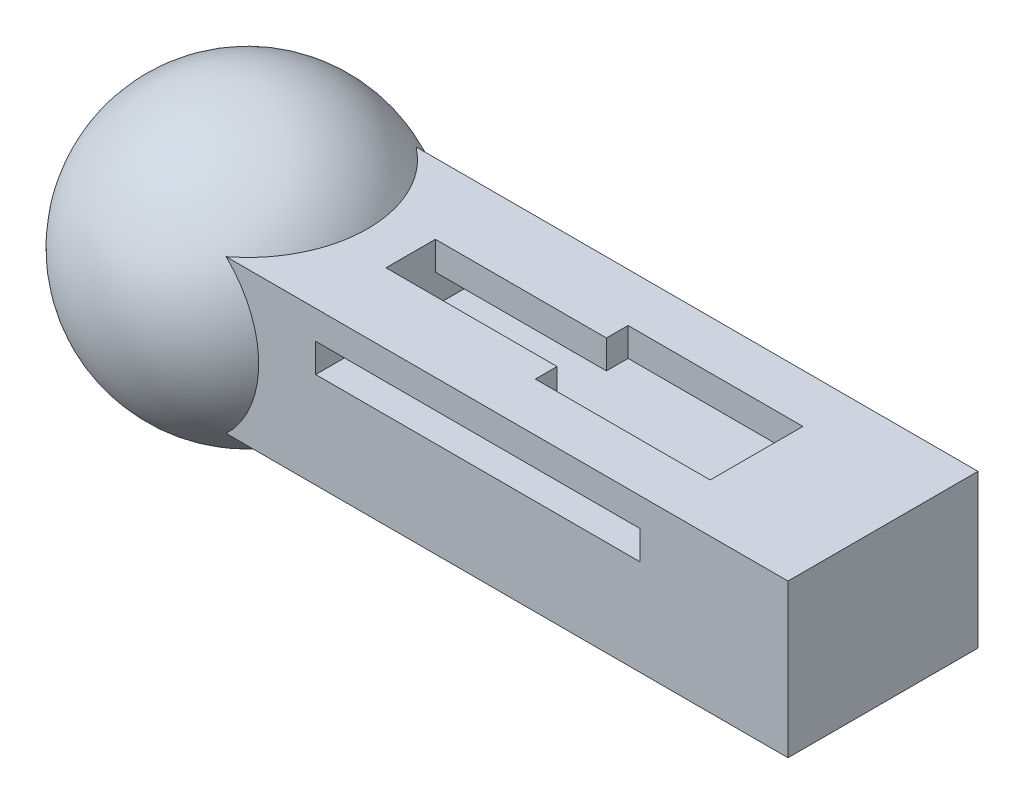
ISO-10303-21;
HEADER;
FILE_DESCRIPTION(('STEP AP214'),'2;1');
FILE_NAME('part.step','',(''),(''),'','','');
FILE_SCHEMA(('AUTOMOTIVE_DESIGN { 1 0 10303 214 1 1 1 1 }'));
ENDSEC;
DATA;
#1=APPLICATION_CONTEXT('core data for automotive mechanical design processes');
#2=APPLICATION_PROTOCOL_DEFINITION('international standard','automotive_design',2000,#1);
#3=PRODUCT_CONTEXT('',#1,'mechanical');
#4=PRODUCT('Part','Part','',(#3));
#5=PRODUCT_RELATED_PRODUCT_CATEGORY('part','',(#4));
#6=PRODUCT_DEFINITION_FORMATION('','',#4);
#7=PRODUCT_DEFINITION_CONTEXT('part definition',#1,'design');
#8=PRODUCT_DEFINITION('design','',#6,#7);
#9=PRODUCT_DEFINITION_SHAPE('','',#8);
#10=(LENGTH_UNIT() NAMED_UNIT(*) SI_UNIT(.MILLI.,.METRE.));
#11=(NAMED_UNIT(*) PLANE_ANGLE_UNIT() SI_UNIT($,.RADIAN.));
#12=(NAMED_UNIT(*) SI_UNIT($,.STERADIAN.) SOLID_ANGLE_UNIT());
#13=UNCERTAINTY_MEASURE_WITH_UNIT(LENGTH_MEASURE(1.E-05),#10,'distance_accuracy_value','');
#14=(GEOMETRIC_REPRESENTATION_CONTEXT(3) GLOBAL_UNCERTAINTY_ASSIGNED_CONTEXT((#13)) GLOBAL_UNIT_ASSIGNED_CONTEXT((#10,
#11,#12)) REPRESENTATION_CONTEXT('',''));
#15=CARTESIAN_POINT('',(0.,0.,0.));
#16=DIRECTION('',(0.,0.,1.));
#17=DIRECTION('',(1.,0.,0.));
#18=AXIS2_PLACEMENT_3D('',#15,#16,#17);
#19=CARTESIAN_POINT('',(-1.88928178356025,6.05539292738649,5.));
#20=DIRECTION('',(0.,-1.,0.));
#21=DIRECTION('',(0.,0.,-1.));
#22=AXIS2_PLACEMENT_3D('',#19,#20,#21);
#23=PLANE('',#22);
#24=DIRECTION('',(-1.,0.,0.));
#25=VECTOR('',#24,1.);
#26=CARTESIAN_POINT('',(-1.88928178356025,6.05539292738649,-5.));
#27=LINE('',#26,#25);
#28=CARTESIAN_POINT('',(24.8543787878777,6.05539292738649,-5.));
#29=VERTEX_POINT('',#28);
#30=CARTESIAN_POINT('',(-4.71168886139568,6.05539292738649,-5.));
#31=VERTEX_POINT('',#30);
#32=EDGE_CURVE('E167',#29,#31,#27,.T.);
#33=ORIENTED_EDGE('',*,*,#32,.T.);
#34=CARTESIAN_POINT('',(-8.58824160789003,6.05539292738649,0.));
#35=DIRECTION('',(0.,-1.,0.));
#36=DIRECTION('',(0.,0.,-1.));
#37=AXIS2_PLACEMENT_3D('',#34,#35,#36);
#38=CIRCLE('',#37,6.32674175198837);
#39=CARTESIAN_POINT('',(-4.71168886139568,6.05539292738649,5.));
#40=VERTEX_POINT('',#39);
#41=EDGE_CURVE('E11',#40,#31,#38,.F.);
#42=ORIENTED_EDGE('',*,*,#41,.F.);
#43=DIRECTION('',(-1.,0.,0.));
#44=VECTOR('',#43,1.);
#45=CARTESIAN_POINT('',(-1.88928178356025,6.05539292738649,5.));
#46=LINE('',#45,#44);
#47=CARTESIAN_POINT('',(24.8543787878777,6.05539292738649,5.));
#48=VERTEX_POINT('',#47);
#49=EDGE_CURVE('E48',#48,#40,#46,.T.);
#50=ORIENTED_EDGE('',*,*,#49,.F.);
#51=DIRECTION('',(0.,0.,-1.));
#52=VECTOR('',#51,1.);
#53=CARTESIAN_POINT('',(24.8543787878777,6.05539292738649,5.));
#54=LINE('',#53,#52);
#55=EDGE_CURVE('E195',#48,#29,#54,.T.);
#56=ORIENTED_EDGE('',*,*,#55,.T.);
#57=EDGE_LOOP('',(#33,#42,#50,#56));
#58=FACE_BOUND('',#57,.T.);
#59=DIRECTION('',(1.,0.,0.));
#60=VECTOR('',#59,1.);
#61=CARTESIAN_POINT('',(0.,6.05539292738649,-1.3));
#62=LINE('',#61,#60);
#63=CARTESIAN_POINT('',(0.,6.05539292738649,-1.3));
#64=VERTEX_POINT('',#63);
#65=CARTESIAN_POINT('',(9.,6.05539292738649,-1.3));
#66=VERTEX_POINT('',#65);
#67=EDGE_CURVE('E268',#64,#66,#62,.T.);
#68=ORIENTED_EDGE('',*,*,#67,.T.);
#69=DIRECTION('',(0.,0.,-1.));
#70=VECTOR('',#69,1.);
#71=CARTESIAN_POINT('',(9.,6.05539292738649,0.));
#72=LINE('',#71,#70);
#73=CARTESIAN_POINT('',(9.,6.05539292738649,-2.44020423042458));
#74=VERTEX_POINT('',#73);
#75=EDGE_CURVE('E271',#66,#74,#72,.T.);
#76=ORIENTED_EDGE('',*,*,#75,.T.);
#77=DIRECTION('',(-1.,0.,0.));
#78=VECTOR('',#77,1.);
#79=CARTESIAN_POINT('',(0.,6.05539292738649,-2.44020423042458));
#80=LINE('',#79,#78);
#81=CARTESIAN_POINT('',(18.2,6.05539292738649,-2.44020423042457));
#82=VERTEX_POINT('',#81);
#83=EDGE_CURVE('E238',#82,#74,#80,.T.);
#84=ORIENTED_EDGE('',*,*,#83,.F.);
#85=DIRECTION('',(0.,0.,1.));
#86=VECTOR('',#85,1.);
#87=CARTESIAN_POINT('',(18.2,6.05539292738649,0.));
#88=LINE('',#87,#86);
#89=CARTESIAN_POINT('',(18.2,6.05539292738649,2.44020423042457));
#90=VERTEX_POINT('',#89);
#91=EDGE_CURVE('E253',#82,#90,#88,.T.);
#92=ORIENTED_EDGE('',*,*,#91,.T.);
#93=DIRECTION('',(-1.,0.,0.));
#94=VECTOR('',#93,1.);
#95=CARTESIAN_POINT('',(0.,6.05539292738649,2.44020423042458));
#96=LINE('',#95,#94);
#97=CARTESIAN_POINT('',(9.,6.05539292738649,2.44020423042458));
#98=VERTEX_POINT('',#97);
#99=EDGE_CURVE('E256',#90,#98,#96,.T.);
#100=ORIENTED_EDGE('',*,*,#99,.T.);
#101=DIRECTION('',(0.,0.,-1.));
#102=VECTOR('',#101,1.);
#103=CARTESIAN_POINT('',(9.,6.05539292738649,0.));
#104=LINE('',#103,#102);
#105=CARTESIAN_POINT('',(9.,6.05539292738649,1.3));
#106=VERTEX_POINT('',#105);
#107=EDGE_CURVE('E259',#98,#106,#104,.T.);
#108=ORIENTED_EDGE('',*,*,#107,.T.);
#109=DIRECTION('',(1.,0.,0.));
#110=VECTOR('',#109,1.);
#111=CARTESIAN_POINT('',(0.,6.05539292738649,1.3));
#112=LINE('',#111,#110);
#113=CARTESIAN_POINT('',(0.,6.05539292738649,1.3));
#114=VERTEX_POINT('',#113);
#115=EDGE_CURVE('E262',#114,#106,#112,.T.);
#116=ORIENTED_EDGE('',*,*,#115,.F.);
#117=DIRECTION('',(0.,0.,-1.));
#118=VECTOR('',#117,1.);
#119=CARTESIAN_POINT('',(0.,6.05539292738649,0.));
#120=LINE('',#119,#118);
#121=EDGE_CURVE('E265',#114,#64,#120,.T.);
#122=ORIENTED_EDGE('',*,*,#121,.T.);
#123=EDGE_LOOP('',(#68,#76,#84,#92,#100,#108,#116,#122));
#124=FACE_BOUND('',#123,.T.);
#125=ADVANCED_FACE('F33',(#58,#124),#23,.F.);
#126=CARTESIAN_POINT('',(17.0669527210989,0.,5.));
#127=DIRECTION('',(-1.,0.,0.));
#128=DIRECTION('',(0.,0.,1.));
#129=AXIS2_PLACEMENT_3D('',#126,#127,#128);
#130=PLANE('',#129);
#131=DIRECTION('',(0.,0.,-1.));
#132=VECTOR('',#131,1.);
#133=CARTESIAN_POINT('',(17.0669527210989,3.04,5.));
#134=LINE('',#133,#132);
#135=CARTESIAN_POINT('',(17.0669527210989,3.04,5.));
#136=VERTEX_POINT('',#135);
#137=CARTESIAN_POINT('',(17.0669527210989,3.04,2.44020423042457));
#138=VERTEX_POINT('',#137);
#139=EDGE_CURVE('E279',#136,#138,#134,.T.);
#140=ORIENTED_EDGE('',*,*,#139,.F.);
#141=DIRECTION('',(0.,1.,0.));
#142=VECTOR('',#141,1.);
#143=CARTESIAN_POINT('',(17.0669527210989,0.,5.));
#144=LINE('',#143,#142);
#145=CARTESIAN_POINT('',(17.0669527210989,4.55539292738649,5.));
#146=VERTEX_POINT('',#145);
#147=EDGE_CURVE('E225',#136,#146,#144,.T.);
#148=ORIENTED_EDGE('',*,*,#147,.T.);
#149=DIRECTION('',(0.,0.,-1.));
#150=VECTOR('',#149,1.);
#151=CARTESIAN_POINT('',(17.0669527210989,4.55539292738649,5.));
#152=LINE('',#151,#150);
#153=CARTESIAN_POINT('',(17.0669527210989,4.55539292738649,2.44020423042457));
#154=VERTEX_POINT('',#153);
#155=EDGE_CURVE('E203',#146,#154,#152,.T.);
#156=ORIENTED_EDGE('',*,*,#155,.T.);
#157=DIRECTION('',(0.,-1.,0.));
#158=VECTOR('',#157,1.);
#159=CARTESIAN_POINT('',(17.0669527210989,0.,2.44020423042457));
#160=LINE('',#159,#158);
#161=EDGE_CURVE('E222',#154,#138,#160,.T.);
#162=ORIENTED_EDGE('',*,*,#161,.T.);
#163=EDGE_LOOP('',(#140,#148,#156,#162));
#164=FACE_BOUND('',#163,.T.);
#165=ADVANCED_FACE('F314',(#164),#130,.T.);
#166=CARTESIAN_POINT('',(0.,4.55539292738649,5.));
#167=DIRECTION('',(0.,-1.,0.));
#168=DIRECTION('',(0.,0.,-1.));
#169=AXIS2_PLACEMENT_3D('',#166,#167,#168);
#170=PLANE('',#169);
#171=DIRECTION('',(0.,0.,1.));
#172=VECTOR('',#171,1.);
#173=CARTESIAN_POINT('',(8.99999999999999,4.55539292738649,5.00000000000001));
#174=LINE('',#173,#172);
#175=CARTESIAN_POINT('',(9.,4.55539292738649,-2.44020423042458));
#176=VERTEX_POINT('',#175);
#177=CARTESIAN_POINT('',(9.,4.55539292738649,-1.3));
#178=VERTEX_POINT('',#177);
#179=EDGE_CURVE('E191',#176,#178,#174,.T.);
#180=ORIENTED_EDGE('',*,*,#179,.T.);
#181=DIRECTION('',(-1.,0.,0.));
#182=VECTOR('',#181,1.);
#183=CARTESIAN_POINT('',(0.,4.55539292738649,-1.3));
#184=LINE('',#183,#182);
#185=CARTESIAN_POINT('',(0.,4.55539292738649,-1.3));
#186=VERTEX_POINT('',#185);
#187=EDGE_CURVE('E186',#178,#186,#184,.T.);
#188=ORIENTED_EDGE('',*,*,#187,.T.);
#189=DIRECTION('',(0.,0.,-1.));
#190=VECTOR('',#189,1.);
#191=CARTESIAN_POINT('',(0.,4.55539292738649,5.));
#192=LINE('',#191,#190);
#193=CARTESIAN_POINT('',(0.,4.55539292738649,-5.));
#194=VERTEX_POINT('',#193);
#195=EDGE_CURVE('E212',#186,#194,#192,.T.);
#196=ORIENTED_EDGE('',*,*,#195,.T.);
#197=DIRECTION('',(-1.,0.,0.));
#198=VECTOR('',#197,1.);
#199=CARTESIAN_POINT('',(0.,4.55539292738649,-5.));
#200=LINE('',#199,#198);
#201=CARTESIAN_POINT('',(17.0669527210989,4.55539292738649,-5.));
#202=VERTEX_POINT('',#201);
#203=EDGE_CURVE('E213',#202,#194,#200,.T.);
#204=ORIENTED_EDGE('',*,*,#203,.F.);
#205=CARTESIAN_POINT('',(17.0669527210989,4.55539292738649,-2.44020423042457));
#206=VERTEX_POINT('',#205);
#207=EDGE_CURVE('E208',#206,#202,#152,.T.);
#208=ORIENTED_EDGE('',*,*,#207,.F.);
#209=DIRECTION('',(1.,0.,0.));
#210=VECTOR('',#209,1.);
#211=CARTESIAN_POINT('',(0.,4.55539292738649,-2.44020423042458));
#212=LINE('',#211,#210);
#213=EDGE_CURVE('E189',#176,#206,#212,.T.);
#214=ORIENTED_EDGE('',*,*,#213,.F.);
#215=EDGE_LOOP('',(#180,#188,#196,#204,#208,#214));
#216=FACE_BOUND('',#215,.T.);
#217=ADVANCED_FACE('F340',(#216),#170,.T.);
#218=CARTESIAN_POINT('',(0.,0.,5.));
#219=DIRECTION('',(0.,0.,-1.));
#220=DIRECTION('',(-1.,0.,0.));
#221=AXIS2_PLACEMENT_3D('',#218,#219,#220);
#222=PLANE('',#221);
#223=ORIENTED_EDGE('',*,*,#147,.F.);
#224=DIRECTION('',(1.,0.,0.));
#225=VECTOR('',#224,1.);
#226=CARTESIAN_POINT('',(0.,3.04,5.));
#227=LINE('',#226,#225);
#228=CARTESIAN_POINT('',(0.,3.04,5.));
#229=VERTEX_POINT('',#228);
#230=EDGE_CURVE('E281',#229,#136,#227,.T.);
#231=ORIENTED_EDGE('',*,*,#230,.F.);
#232=DIRECTION('',(0.,-1.,0.));
#233=VECTOR('',#232,1.);
#234=CARTESIAN_POINT('',(0.,0.,5.));
#235=LINE('',#234,#233);
#236=CARTESIAN_POINT('',(0.,4.55539292738649,5.));
#237=VERTEX_POINT('',#236);
#238=EDGE_CURVE('E216',#237,#229,#235,.T.);
#239=ORIENTED_EDGE('',*,*,#238,.F.);
#240=DIRECTION('',(-1.,0.,0.));
#241=VECTOR('',#240,1.);
#242=CARTESIAN_POINT('',(0.,4.55539292738649,5.));
#243=LINE('',#242,#241);
#244=EDGE_CURVE('E223',#146,#237,#243,.T.);
#245=ORIENTED_EDGE('',*,*,#244,.F.);
#246=EDGE_LOOP('',(#223,#231,#239,#245));
#247=FACE_BOUND('',#246,.T.);
#248=ORIENTED_EDGE('',*,*,#49,.T.);
#249=CARTESIAN_POINT('',(-8.58824160789003,2.02769646369325,5.));
#250=DIRECTION('',(0.,0.,-1.));
#251=DIRECTION('',(-1.,0.,0.));
#252=AXIS2_PLACEMENT_3D('',#249,#250,#251);
#253=CIRCLE('',#252,5.59016994374947);
#254=CARTESIAN_POINT('',(-4.71168886139568,-2.,5.));
#255=VERTEX_POINT('',#254);
#256=EDGE_CURVE('E170',#255,#40,#253,.F.);
#257=ORIENTED_EDGE('',*,*,#256,.F.);
#258=DIRECTION('',(1.,0.,0.));
#259=VECTOR('',#258,1.);
#260=CARTESIAN_POINT('',(-1.88928178356025,-2.,5.));
#261=LINE('',#260,#259);
#262=CARTESIAN_POINT('',(24.8543787878777,-2.,5.));
#263=VERTEX_POINT('',#262);
#264=EDGE_CURVE('E159',#255,#263,#261,.T.);
#265=ORIENTED_EDGE('',*,*,#264,.T.);
#266=DIRECTION('',(0.,1.,0.));
#267=VECTOR('',#266,1.);
#268=CARTESIAN_POINT('',(24.8543787878777,-2.,5.));
#269=LINE('',#268,#267);
#270=EDGE_CURVE('E166',#263,#48,#269,.T.);
#271=ORIENTED_EDGE('',*,*,#270,.T.);
#272=EDGE_LOOP('',(#248,#257,#265,#271));
#273=FACE_BOUND('',#272,.T.);
#274=ADVANCED_FACE('F171',(#247,#273),#222,.F.);
#275=CARTESIAN_POINT('',(0.,0.,-5.));
#276=DIRECTION('',(0.,0.,-1.));
#277=DIRECTION('',(-1.,0.,0.));
#278=AXIS2_PLACEMENT_3D('',#275,#276,#277);
#279=PLANE('',#278);
#280=DIRECTION('',(1.,0.,0.));
#281=VECTOR('',#280,1.);
#282=CARTESIAN_POINT('',(-1.88928178356025,-2.,-5.));
#283=LINE('',#282,#281);
#284=CARTESIAN_POINT('',(-4.71168886139568,-2.,-5.));
#285=VERTEX_POINT('',#284);
#286=CARTESIAN_POINT('',(24.8543787878777,-2.,-5.));
#287=VERTEX_POINT('',#286);
#288=EDGE_CURVE('E201',#285,#287,#283,.T.);
#289=ORIENTED_EDGE('',*,*,#288,.F.);
#290=CARTESIAN_POINT('',(-8.58824160789003,2.02769646369325,-5.));
#291=DIRECTION('',(0.,0.,1.));
#292=DIRECTION('',(1.,0.,0.));
#293=AXIS2_PLACEMENT_3D('',#290,#291,#292);
#294=CIRCLE('',#293,5.59016994374947);
#295=EDGE_CURVE('E41',#31,#285,#294,.F.);
#296=ORIENTED_EDGE('',*,*,#295,.F.);
#297=ORIENTED_EDGE('',*,*,#32,.F.);
#298=DIRECTION('',(0.,1.,0.));
#299=VECTOR('',#298,1.);
#300=CARTESIAN_POINT('',(24.8543787878777,-2.,-5.));
#301=LINE('',#300,#299);
#302=EDGE_CURVE('E199',#287,#29,#301,.T.);
#303=ORIENTED_EDGE('',*,*,#302,.F.);
#304=EDGE_LOOP('',(#289,#296,#297,#303));
#305=FACE_BOUND('',#304,.T.);
#306=ORIENTED_EDGE('',*,*,#203,.T.);
#307=DIRECTION('',(0.,-1.,0.));
#308=VECTOR('',#307,1.);
#309=CARTESIAN_POINT('',(0.,0.,-5.));
#310=LINE('',#309,#308);
#311=CARTESIAN_POINT('',(0.,3.04,-5.));
#312=VERTEX_POINT('',#311);
#313=EDGE_CURVE('E219',#194,#312,#310,.T.);
#314=ORIENTED_EDGE('',*,*,#313,.T.);
#315=DIRECTION('',(-1.,0.,0.));
#316=VECTOR('',#315,1.);
#317=CARTESIAN_POINT('',(17.0669527210989,3.04,-5.));
#318=LINE('',#317,#316);
#319=CARTESIAN_POINT('',(17.0669527210989,3.04,-5.));
#320=VERTEX_POINT('',#319);
#321=EDGE_CURVE('E285',#320,#312,#318,.T.);
#322=ORIENTED_EDGE('',*,*,#321,.F.);
#323=DIRECTION('',(0.,1.,0.));
#324=VECTOR('',#323,1.);
#325=CARTESIAN_POINT('',(17.0669527210989,0.,-5.));
#326=LINE('',#325,#324);
#327=EDGE_CURVE('E217',#320,#202,#326,.T.);
#328=ORIENTED_EDGE('',*,*,#327,.T.);
#329=EDGE_LOOP('',(#306,#314,#322,#328));
#330=FACE_BOUND('',#329,.T.);
#331=ADVANCED_FACE('F300',(#305,#330),#279,.T.);
#332=CARTESIAN_POINT('',(-1.88928178356025,-2.,5.));
#333=DIRECTION('',(0.,1.,0.));
#334=DIRECTION('',(0.,0.,1.));
#335=AXIS2_PLACEMENT_3D('',#332,#333,#334);
#336=PLANE('',#335);
#337=ORIENTED_EDGE('',*,*,#288,.T.);
#338=DIRECTION('',(0.,0.,-1.));
#339=VECTOR('',#338,1.);
#340=CARTESIAN_POINT('',(24.8543787878777,-2.,5.));
#341=LINE('',#340,#339);
#342=EDGE_CURVE('E164',#263,#287,#341,.T.);
#343=ORIENTED_EDGE('',*,*,#342,.F.);
#344=ORIENTED_EDGE('',*,*,#264,.F.);
#345=CARTESIAN_POINT('',(-8.58824160789003,-2.,0.));
#346=DIRECTION('',(0.,1.,0.));
#347=DIRECTION('',(0.,0.,1.));
#348=AXIS2_PLACEMENT_3D('',#345,#346,#347);
#349=CIRCLE('',#348,6.32674175198837);
#350=EDGE_CURVE('E161',#285,#255,#349,.F.);
#351=ORIENTED_EDGE('',*,*,#350,.F.);
#352=EDGE_LOOP('',(#337,#343,#344,#351));
#353=FACE_BOUND('',#352,.T.);
#354=ADVANCED_FACE('F35',(#353),#336,.F.);
#355=CARTESIAN_POINT('',(24.8543787878777,-2.,5.));
#356=DIRECTION('',(-1.,0.,0.));
#357=DIRECTION('',(0.,0.,1.));
#358=AXIS2_PLACEMENT_3D('',#355,#356,#357);
#359=PLANE('',#358);
#360=ORIENTED_EDGE('',*,*,#302,.T.);
#361=ORIENTED_EDGE('',*,*,#55,.F.);
#362=ORIENTED_EDGE('',*,*,#270,.F.);
#363=ORIENTED_EDGE('',*,*,#342,.T.);
#364=EDGE_LOOP('',(#360,#361,#362,#363));
#365=FACE_BOUND('',#364,.T.);
#366=ADVANCED_FACE('F369',(#365),#359,.F.);
#367=CARTESIAN_POINT('',(0.,0.,5.));
#368=DIRECTION('',(1.,0.,0.));
#369=DIRECTION('',(0.,0.,-1.));
#370=AXIS2_PLACEMENT_3D('',#367,#368,#369);
#371=PLANE('',#370);
#372=DIRECTION('',(0.,0.,1.));
#373=VECTOR('',#372,1.);
#374=CARTESIAN_POINT('',(0.,3.04,-5.));
#375=LINE('',#374,#373);
#376=EDGE_CURVE('E283',#312,#229,#375,.T.);
#377=ORIENTED_EDGE('',*,*,#376,.F.);
#378=ORIENTED_EDGE('',*,*,#313,.F.);
#379=ORIENTED_EDGE('',*,*,#195,.F.);
#380=DIRECTION('',(0.,1.,0.));
#381=VECTOR('',#380,1.);
#382=CARTESIAN_POINT('',(0.,-18.8429930410412,-1.3));
#383=LINE('',#382,#381);
#384=EDGE_CURVE('E237',#186,#64,#383,.T.);
#385=ORIENTED_EDGE('',*,*,#384,.T.);
#386=ORIENTED_EDGE('',*,*,#121,.F.);
#387=DIRECTION('',(0.,1.,0.));
#388=VECTOR('',#387,1.);
#389=CARTESIAN_POINT('',(0.,-18.8429930410412,1.3));
#390=LINE('',#389,#388);
#391=CARTESIAN_POINT('',(0.,4.55539292738649,1.3));
#392=VERTEX_POINT('',#391);
#393=EDGE_CURVE('E240',#392,#114,#390,.T.);
#394=ORIENTED_EDGE('',*,*,#393,.F.);
#395=EDGE_CURVE('E209',#237,#392,#192,.T.);
#396=ORIENTED_EDGE('',*,*,#395,.F.);
#397=ORIENTED_EDGE('',*,*,#238,.T.);
#398=EDGE_LOOP('',(#377,#378,#379,#385,#386,#394,#396,#397));
#399=FACE_BOUND('',#398,.T.);
#400=ADVANCED_FACE('F304',(#399),#371,.T.);
#401=DIRECTION('',(0.,0.,-1.));
#402=VECTOR('',#401,1.);
#403=CARTESIAN_POINT('',(17.0669527210989,3.04,-2.44020423042457));
#404=LINE('',#403,#402);
#405=CARTESIAN_POINT('',(17.0669527210989,3.04,-2.44020423042457));
#406=VERTEX_POINT('',#405);
#407=EDGE_CURVE('E287',#406,#320,#404,.T.);
#408=ORIENTED_EDGE('',*,*,#407,.F.);
#409=DIRECTION('',(0.,-1.,0.));
#410=VECTOR('',#409,1.);
#411=CARTESIAN_POINT('',(17.0669527210989,0.,-2.44020423042457));
#412=LINE('',#411,#410);
#413=EDGE_CURVE('E231',#206,#406,#412,.T.);
#414=ORIENTED_EDGE('',*,*,#413,.F.);
#415=ORIENTED_EDGE('',*,*,#207,.T.);
#416=ORIENTED_EDGE('',*,*,#327,.F.);
#417=EDGE_LOOP('',(#408,#414,#415,#416));
#418=FACE_BOUND('',#417,.T.);
#419=ADVANCED_FACE('F296',(#418),#130,.T.);
#420=DIRECTION('',(-1.,0.,0.));
#421=VECTOR('',#420,1.);
#422=CARTESIAN_POINT('',(0.,4.55539292738649,1.3));
#423=LINE('',#422,#421);
#424=CARTESIAN_POINT('',(9.,4.55539292738649,1.3));
#425=VERTEX_POINT('',#424);
#426=EDGE_CURVE('E173',#425,#392,#423,.T.);
#427=ORIENTED_EDGE('',*,*,#426,.F.);
#428=DIRECTION('',(0.,0.,1.));
#429=VECTOR('',#428,1.);
#430=CARTESIAN_POINT('',(9.00000000000001,4.55539292738649,4.99999999999999));
#431=LINE('',#430,#429);
#432=CARTESIAN_POINT('',(9.,4.55539292738649,2.44020423042458));
#433=VERTEX_POINT('',#432);
#434=EDGE_CURVE('E180',#425,#433,#431,.T.);
#435=ORIENTED_EDGE('',*,*,#434,.T.);
#436=DIRECTION('',(1.,0.,0.));
#437=VECTOR('',#436,1.);
#438=CARTESIAN_POINT('',(0.,4.55539292738649,2.44020423042458));
#439=LINE('',#438,#437);
#440=EDGE_CURVE('E183',#433,#154,#439,.T.);
#441=ORIENTED_EDGE('',*,*,#440,.T.);
#442=ORIENTED_EDGE('',*,*,#155,.F.);
#443=ORIENTED_EDGE('',*,*,#244,.T.);
#444=ORIENTED_EDGE('',*,*,#395,.T.);
#445=EDGE_LOOP('',(#427,#435,#441,#442,#443,#444));
#446=FACE_BOUND('',#445,.T.);
#447=ADVANCED_FACE('F317',(#446),#170,.T.);
#448=CARTESIAN_POINT('',(0.,-18.8429930410412,-1.3));
#449=DIRECTION('',(0.,0.,1.));
#450=DIRECTION('',(1.,0.,0.));
#451=AXIS2_PLACEMENT_3D('',#448,#449,#450);
#452=PLANE('',#451);
#453=DIRECTION('',(0.,1.,0.));
#454=VECTOR('',#453,1.);
#455=CARTESIAN_POINT('',(9.,-18.8429930410412,-1.3));
#456=LINE('',#455,#454);
#457=EDGE_CURVE('E235',#178,#66,#456,.T.);
#458=ORIENTED_EDGE('',*,*,#457,.T.);
#459=ORIENTED_EDGE('',*,*,#67,.F.);
#460=ORIENTED_EDGE('',*,*,#384,.F.);
#461=ORIENTED_EDGE('',*,*,#187,.F.);
#462=EDGE_LOOP('',(#458,#459,#460,#461));
#463=FACE_BOUND('',#462,.T.);
#464=ADVANCED_FACE('F343',(#463),#452,.T.);
#465=CARTESIAN_POINT('',(0.,-18.8429930410412,1.3));
#466=DIRECTION('',(0.,0.,1.));
#467=DIRECTION('',(1.,0.,0.));
#468=AXIS2_PLACEMENT_3D('',#465,#466,#467);
#469=PLANE('',#468);
#470=ORIENTED_EDGE('',*,*,#426,.T.);
#471=ORIENTED_EDGE('',*,*,#393,.T.);
#472=ORIENTED_EDGE('',*,*,#115,.T.);
#473=DIRECTION('',(0.,1.,0.));
#474=VECTOR('',#473,1.);
#475=CARTESIAN_POINT('',(9.,-18.8429930410412,1.3));
#476=LINE('',#475,#474);
#477=EDGE_CURVE('E242',#425,#106,#476,.T.);
#478=ORIENTED_EDGE('',*,*,#477,.F.);
#479=EDGE_LOOP('',(#470,#471,#472,#478));
#480=FACE_BOUND('',#479,.T.);
#481=ADVANCED_FACE('F349',(#480),#469,.F.);
#482=CARTESIAN_POINT('',(9.,-18.8429930410412,0.));
#483=DIRECTION('',(1.,0.,0.));
#484=DIRECTION('',(0.,0.,-1.));
#485=AXIS2_PLACEMENT_3D('',#482,#483,#484);
#486=PLANE('',#485);
#487=ORIENTED_EDGE('',*,*,#477,.T.);
#488=ORIENTED_EDGE('',*,*,#107,.F.);
#489=DIRECTION('',(0.,1.,0.));
#490=VECTOR('',#489,1.);
#491=CARTESIAN_POINT('',(9.,-18.8429930410412,2.44020423042458));
#492=LINE('',#491,#490);
#493=EDGE_CURVE('E244',#433,#98,#492,.T.);
#494=ORIENTED_EDGE('',*,*,#493,.F.);
#495=ORIENTED_EDGE('',*,*,#434,.F.);
#496=EDGE_LOOP('',(#487,#488,#494,#495));
#497=FACE_BOUND('',#496,.T.);
#498=ADVANCED_FACE('F325',(#497),#486,.T.);
#499=CARTESIAN_POINT('',(0.,-18.8429930410412,2.44020423042458));
#500=DIRECTION('',(0.,0.,-1.));
#501=DIRECTION('',(-1.,0.,0.));
#502=AXIS2_PLACEMENT_3D('',#499,#500,#501);
#503=PLANE('',#502);
#504=DIRECTION('',(1.,0.,0.));
#505=VECTOR('',#504,1.);
#506=CARTESIAN_POINT('',(17.0669527210989,3.04,2.44020423042457));
#507=LINE('',#506,#505);
#508=CARTESIAN_POINT('',(18.2,3.04,2.44020423042457));
#509=VERTEX_POINT('',#508);
#510=EDGE_CURVE('E277',#138,#509,#507,.T.);
#511=ORIENTED_EDGE('',*,*,#510,.F.);
#512=ORIENTED_EDGE('',*,*,#161,.F.);
#513=ORIENTED_EDGE('',*,*,#440,.F.);
#514=ORIENTED_EDGE('',*,*,#493,.T.);
#515=ORIENTED_EDGE('',*,*,#99,.F.);
#516=DIRECTION('',(0.,1.,0.));
#517=VECTOR('',#516,1.);
#518=CARTESIAN_POINT('',(18.2,-18.8429930410412,2.44020423042457));
#519=LINE('',#518,#517);
#520=EDGE_CURVE('E246',#509,#90,#519,.T.);
#521=ORIENTED_EDGE('',*,*,#520,.F.);
#522=EDGE_LOOP('',(#511,#512,#513,#514,#515,#521));
#523=FACE_BOUND('',#522,.T.);
#524=ADVANCED_FACE('F321',(#523),#503,.T.);
#525=CARTESIAN_POINT('',(18.2,-18.8429930410412,0.));
#526=DIRECTION('',(-1.,0.,0.));
#527=DIRECTION('',(0.,0.,1.));
#528=AXIS2_PLACEMENT_3D('',#525,#526,#527);
#529=PLANE('',#528);
#530=DIRECTION('',(0.,0.,-1.));
#531=VECTOR('',#530,1.);
#532=CARTESIAN_POINT('',(18.2,3.04,2.44020423042457));
#533=LINE('',#532,#531);
#534=CARTESIAN_POINT('',(18.2,3.04,-2.44020423042457));
#535=VERTEX_POINT('',#534);
#536=EDGE_CURVE('E56',#509,#535,#533,.T.);
#537=ORIENTED_EDGE('',*,*,#536,.F.);
#538=ORIENTED_EDGE('',*,*,#520,.T.);
#539=ORIENTED_EDGE('',*,*,#91,.F.);
#540=DIRECTION('',(0.,1.,0.));
#541=VECTOR('',#540,1.);
#542=CARTESIAN_POINT('',(18.2,-18.8429930410412,-2.44020423042457));
#543=LINE('',#542,#541);
#544=EDGE_CURVE('E248',#535,#82,#543,.T.);
#545=ORIENTED_EDGE('',*,*,#544,.F.);
#546=EDGE_LOOP('',(#537,#538,#539,#545));
#547=FACE_BOUND('',#546,.T.);
#548=ADVANCED_FACE('F333',(#547),#529,.T.);
#549=CARTESIAN_POINT('',(0.,-18.8429930410412,-2.44020423042458));
#550=DIRECTION('',(0.,0.,-1.));
#551=DIRECTION('',(-1.,0.,0.));
#552=AXIS2_PLACEMENT_3D('',#549,#550,#551);
#553=PLANE('',#552);
#554=ORIENTED_EDGE('',*,*,#413,.T.);
#555=DIRECTION('',(-1.,0.,0.));
#556=VECTOR('',#555,1.);
#557=CARTESIAN_POINT('',(18.2,3.04,-2.44020423042457));
#558=LINE('',#557,#556);
#559=EDGE_CURVE('E274',#535,#406,#558,.T.);
#560=ORIENTED_EDGE('',*,*,#559,.F.);
#561=ORIENTED_EDGE('',*,*,#544,.T.);
#562=ORIENTED_EDGE('',*,*,#83,.T.);
#563=DIRECTION('',(0.,1.,0.));
#564=VECTOR('',#563,1.);
#565=CARTESIAN_POINT('',(9.,-18.8429930410412,-2.44020423042458));
#566=LINE('',#565,#564);
#567=EDGE_CURVE('E234',#176,#74,#566,.T.);
#568=ORIENTED_EDGE('',*,*,#567,.F.);
#569=ORIENTED_EDGE('',*,*,#213,.T.);
#570=EDGE_LOOP('',(#554,#560,#561,#562,#568,#569));
#571=FACE_BOUND('',#570,.T.);
#572=ADVANCED_FACE('F336',(#571),#553,.F.);
#573=CARTESIAN_POINT('',(9.,-18.8429930410412,0.));
#574=DIRECTION('',(1.,0.,0.));
#575=DIRECTION('',(0.,0.,-1.));
#576=AXIS2_PLACEMENT_3D('',#573,#574,#575);
#577=PLANE('',#576);
#578=ORIENTED_EDGE('',*,*,#567,.T.);
#579=ORIENTED_EDGE('',*,*,#75,.F.);
#580=ORIENTED_EDGE('',*,*,#457,.F.);
#581=ORIENTED_EDGE('',*,*,#179,.F.);
#582=EDGE_LOOP('',(#578,#579,#580,#581));
#583=FACE_BOUND('',#582,.T.);
#584=ADVANCED_FACE('F391',(#583),#577,.T.);
#585=CARTESIAN_POINT('',(0.,3.04,0.));
#586=DIRECTION('',(0.,1.,0.));
#587=DIRECTION('',(0.,0.,1.));
#588=AXIS2_PLACEMENT_3D('',#585,#586,#587);
#589=PLANE('',#588);
#590=ORIENTED_EDGE('',*,*,#407,.T.);
#591=ORIENTED_EDGE('',*,*,#321,.T.);
#592=ORIENTED_EDGE('',*,*,#376,.T.);
#593=ORIENTED_EDGE('',*,*,#230,.T.);
#594=ORIENTED_EDGE('',*,*,#139,.T.);
#595=ORIENTED_EDGE('',*,*,#510,.T.);
#596=ORIENTED_EDGE('',*,*,#536,.T.);
#597=ORIENTED_EDGE('',*,*,#559,.T.);
#598=EDGE_LOOP('',(#590,#591,#592,#593,#594,#595,#596,#597));
#599=FACE_BOUND('',#598,.T.);
#600=ADVANCED_FACE('F291',(#599),#589,.T.);
#601=CARTESIAN_POINT('',(-8.58824160789003,2.02769646369325,0.));
#602=DIRECTION('',(1.,0.,0.));
#603=DIRECTION('',(0.,-1.,0.));
#604=AXIS2_PLACEMENT_3D('',#601,#602,#603);
#605=SPHERICAL_SURFACE('',#604,7.5);
#606=ORIENTED_EDGE('',*,*,#256,.T.);
#607=ORIENTED_EDGE('',*,*,#41,.T.);
#608=ORIENTED_EDGE('',*,*,#295,.T.);
#609=ORIENTED_EDGE('',*,*,#350,.T.);
#610=EDGE_LOOP('',(#606,#607,#608,#609));
#611=FACE_BOUND('',#610,.T.);
#612=ADVANCED_FACE('F175',(#611),#605,.T.);
#613=CLOSED_SHELL('',(#125,#165,#217,#274,#331,#354,#366,#400,#419,#447,#464,#481,#498,#524,
#548,#572,#584,#600,#612));
#614=MANIFOLD_SOLID_BREP('B2',#613);
#615=ADVANCED_BREP_SHAPE_REPRESENTATION('',(#18,#614),#14);
#616=SHAPE_DEFINITION_REPRESENTATION(#9,#615);
ENDSEC;
END-ISO-10303-21;
